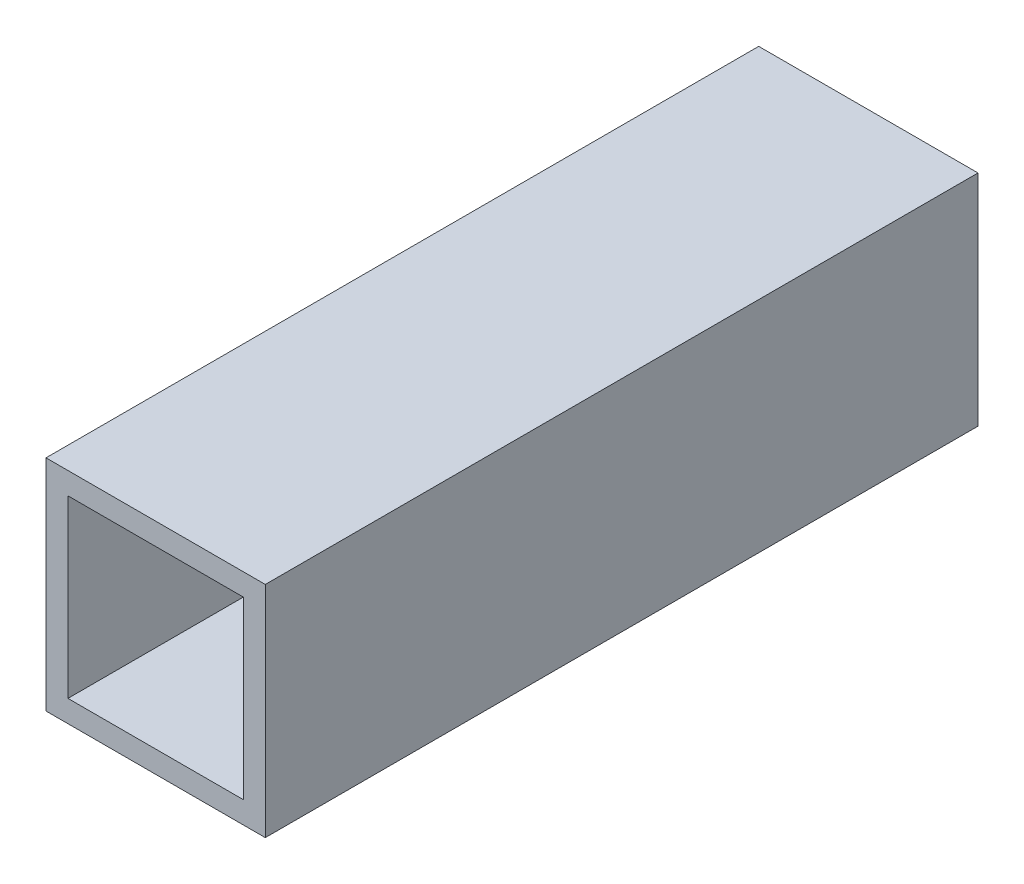
ISO-10303-21;
HEADER;
FILE_DESCRIPTION(('STEP AP214'),'2;1');
FILE_NAME('part.step','',(''),(''),'','','');
FILE_SCHEMA(('AUTOMOTIVE_DESIGN { 1 0 10303 214 1 1 1 1 }'));
ENDSEC;
DATA;
#1=APPLICATION_CONTEXT('core data for automotive mechanical design processes');
#2=APPLICATION_PROTOCOL_DEFINITION('international standard','automotive_design',2000,#1);
#3=PRODUCT_CONTEXT('',#1,'mechanical');
#4=PRODUCT('Part','Part','',(#3));
#5=PRODUCT_RELATED_PRODUCT_CATEGORY('part','',(#4));
#6=PRODUCT_DEFINITION_FORMATION('','',#4);
#7=PRODUCT_DEFINITION_CONTEXT('part definition',#1,'design');
#8=PRODUCT_DEFINITION('design','',#6,#7);
#9=PRODUCT_DEFINITION_SHAPE('','',#8);
#10=(LENGTH_UNIT() NAMED_UNIT(*) SI_UNIT(.MILLI.,.METRE.));
#11=(NAMED_UNIT(*) PLANE_ANGLE_UNIT() SI_UNIT($,.RADIAN.));
#12=(NAMED_UNIT(*) SI_UNIT($,.STERADIAN.) SOLID_ANGLE_UNIT());
#13=UNCERTAINTY_MEASURE_WITH_UNIT(LENGTH_MEASURE(1.E-05),#10,'distance_accuracy_value','');
#14=(GEOMETRIC_REPRESENTATION_CONTEXT(3) GLOBAL_UNCERTAINTY_ASSIGNED_CONTEXT((#13)) GLOBAL_UNIT_ASSIGNED_CONTEXT((#10,
#11,#12)) REPRESENTATION_CONTEXT('',''));
#15=CARTESIAN_POINT('',(0.,0.,0.));
#16=DIRECTION('',(0.,0.,1.));
#17=DIRECTION('',(1.,0.,0.));
#18=AXIS2_PLACEMENT_3D('',#15,#16,#17);
#19=CARTESIAN_POINT('',(0.,0.,130.));
#20=DIRECTION('',(0.,0.,-1.));
#21=DIRECTION('',(-1.,0.,0.));
#22=AXIS2_PLACEMENT_3D('',#19,#20,#21);
#23=PLANE('',#22);
#24=DIRECTION('',(0.,-1.,0.));
#25=VECTOR('',#24,1.);
#26=CARTESIAN_POINT('',(0.,0.,130.));
#27=LINE('',#26,#25);
#28=CARTESIAN_POINT('',(0.,40.,130.));
#29=VERTEX_POINT('',#28);
#30=CARTESIAN_POINT('',(0.,0.,130.));
#31=VERTEX_POINT('',#30);
#32=EDGE_CURVE('E138',#29,#31,#27,.T.);
#33=ORIENTED_EDGE('',*,*,#32,.T.);
#34=DIRECTION('',(1.,0.,0.));
#35=VECTOR('',#34,1.);
#36=CARTESIAN_POINT('',(0.,0.,130.));
#37=LINE('',#36,#35);
#38=CARTESIAN_POINT('',(40.,0.,130.));
#39=VERTEX_POINT('',#38);
#40=EDGE_CURVE('E141',#31,#39,#37,.T.);
#41=ORIENTED_EDGE('',*,*,#40,.T.);
#42=DIRECTION('',(0.,1.,0.));
#43=VECTOR('',#42,1.);
#44=CARTESIAN_POINT('',(40.,0.,130.));
#45=LINE('',#44,#43);
#46=CARTESIAN_POINT('',(40.,40.,130.));
#47=VERTEX_POINT('',#46);
#48=EDGE_CURVE('E144',#39,#47,#45,.T.);
#49=ORIENTED_EDGE('',*,*,#48,.T.);
#50=DIRECTION('',(-1.,0.,0.));
#51=VECTOR('',#50,1.);
#52=CARTESIAN_POINT('',(0.,40.,130.));
#53=LINE('',#52,#51);
#54=EDGE_CURVE('E146',#47,#29,#53,.T.);
#55=ORIENTED_EDGE('',*,*,#54,.T.);
#56=EDGE_LOOP('',(#33,#41,#49,#55));
#57=FACE_BOUND('',#56,.T.);
#58=DIRECTION('',(0.,-1.,0.));
#59=VECTOR('',#58,1.);
#60=CARTESIAN_POINT('',(4.,4.,130.));
#61=LINE('',#60,#59);
#62=CARTESIAN_POINT('',(4.,36.,130.));
#63=VERTEX_POINT('',#62);
#64=CARTESIAN_POINT('',(4.,4.,130.));
#65=VERTEX_POINT('',#64);
#66=EDGE_CURVE('E102',#63,#65,#61,.T.);
#67=ORIENTED_EDGE('',*,*,#66,.F.);
#68=DIRECTION('',(-1.,0.,0.));
#69=VECTOR('',#68,1.);
#70=CARTESIAN_POINT('',(4.,36.,130.));
#71=LINE('',#70,#69);
#72=CARTESIAN_POINT('',(36.,36.,130.));
#73=VERTEX_POINT('',#72);
#74=EDGE_CURVE('E124',#73,#63,#71,.T.);
#75=ORIENTED_EDGE('',*,*,#74,.F.);
#76=DIRECTION('',(0.,1.,0.));
#77=VECTOR('',#76,1.);
#78=CARTESIAN_POINT('',(36.,4.,130.));
#79=LINE('',#78,#77);
#80=CARTESIAN_POINT('',(36.,4.,130.));
#81=VERTEX_POINT('',#80);
#82=EDGE_CURVE('E122',#81,#73,#79,.T.);
#83=ORIENTED_EDGE('',*,*,#82,.F.);
#84=DIRECTION('',(1.,0.,0.));
#85=VECTOR('',#84,1.);
#86=CARTESIAN_POINT('',(4.,4.,130.));
#87=LINE('',#86,#85);
#88=EDGE_CURVE('E110',#65,#81,#87,.T.);
#89=ORIENTED_EDGE('',*,*,#88,.F.);
#90=EDGE_LOOP('',(#67,#75,#83,#89));
#91=FACE_BOUND('',#90,.T.);
#92=ADVANCED_FACE('F37',(#57,#91),#23,.F.);
#93=CARTESIAN_POINT('',(0.,0.,0.));
#94=DIRECTION('',(0.,0.,-1.));
#95=DIRECTION('',(-1.,0.,0.));
#96=AXIS2_PLACEMENT_3D('',#93,#94,#95);
#97=PLANE('',#96);
#98=DIRECTION('',(0.,-1.,0.));
#99=VECTOR('',#98,1.);
#100=CARTESIAN_POINT('',(0.,0.,0.));
#101=LINE('',#100,#99);
#102=CARTESIAN_POINT('',(0.,40.,0.));
#103=VERTEX_POINT('',#102);
#104=CARTESIAN_POINT('',(0.,0.,0.));
#105=VERTEX_POINT('',#104);
#106=EDGE_CURVE('E118',#103,#105,#101,.T.);
#107=ORIENTED_EDGE('',*,*,#106,.F.);
#108=DIRECTION('',(-1.,0.,0.));
#109=VECTOR('',#108,1.);
#110=CARTESIAN_POINT('',(0.,40.,0.));
#111=LINE('',#110,#109);
#112=CARTESIAN_POINT('',(40.,40.,0.));
#113=VERTEX_POINT('',#112);
#114=EDGE_CURVE('E142',#113,#103,#111,.T.);
#115=ORIENTED_EDGE('',*,*,#114,.F.);
#116=DIRECTION('',(0.,1.,0.));
#117=VECTOR('',#116,1.);
#118=CARTESIAN_POINT('',(40.,0.,0.));
#119=LINE('',#118,#117);
#120=CARTESIAN_POINT('',(40.,0.,0.));
#121=VERTEX_POINT('',#120);
#122=EDGE_CURVE('E153',#121,#113,#119,.T.);
#123=ORIENTED_EDGE('',*,*,#122,.F.);
#124=DIRECTION('',(1.,0.,0.));
#125=VECTOR('',#124,1.);
#126=CARTESIAN_POINT('',(0.,0.,0.));
#127=LINE('',#126,#125);
#128=EDGE_CURVE('E151',#105,#121,#127,.T.);
#129=ORIENTED_EDGE('',*,*,#128,.F.);
#130=EDGE_LOOP('',(#107,#115,#123,#129));
#131=FACE_BOUND('',#130,.T.);
#132=DIRECTION('',(-1.,0.,0.));
#133=VECTOR('',#132,1.);
#134=CARTESIAN_POINT('',(4.,36.,0.));
#135=LINE('',#134,#133);
#136=CARTESIAN_POINT('',(36.,36.,0.));
#137=VERTEX_POINT('',#136);
#138=CARTESIAN_POINT('',(4.,36.,0.));
#139=VERTEX_POINT('',#138);
#140=EDGE_CURVE('E111',#137,#139,#135,.T.);
#141=ORIENTED_EDGE('',*,*,#140,.T.);
#142=DIRECTION('',(0.,-1.,0.));
#143=VECTOR('',#142,1.);
#144=CARTESIAN_POINT('',(4.,4.,0.));
#145=LINE('',#144,#143);
#146=CARTESIAN_POINT('',(4.,4.,0.));
#147=VERTEX_POINT('',#146);
#148=EDGE_CURVE('E60',#139,#147,#145,.T.);
#149=ORIENTED_EDGE('',*,*,#148,.T.);
#150=DIRECTION('',(1.,0.,0.));
#151=VECTOR('',#150,1.);
#152=CARTESIAN_POINT('',(4.,4.,0.));
#153=LINE('',#152,#151);
#154=CARTESIAN_POINT('',(36.,4.,0.));
#155=VERTEX_POINT('',#154);
#156=EDGE_CURVE('E117',#147,#155,#153,.T.);
#157=ORIENTED_EDGE('',*,*,#156,.T.);
#158=DIRECTION('',(0.,1.,0.));
#159=VECTOR('',#158,1.);
#160=CARTESIAN_POINT('',(36.,4.,0.));
#161=LINE('',#160,#159);
#162=EDGE_CURVE('E130',#155,#137,#161,.T.);
#163=ORIENTED_EDGE('',*,*,#162,.T.);
#164=EDGE_LOOP('',(#141,#149,#157,#163));
#165=FACE_BOUND('',#164,.T.);
#166=ADVANCED_FACE('F171',(#131,#165),#97,.T.);
#167=CARTESIAN_POINT('',(0.,0.,130.));
#168=DIRECTION('',(1.,0.,0.));
#169=DIRECTION('',(0.,0.,-1.));
#170=AXIS2_PLACEMENT_3D('',#167,#168,#169);
#171=PLANE('',#170);
#172=ORIENTED_EDGE('',*,*,#106,.T.);
#173=DIRECTION('',(0.,0.,-1.));
#174=VECTOR('',#173,1.);
#175=CARTESIAN_POINT('',(0.,0.,130.));
#176=LINE('',#175,#174);
#177=EDGE_CURVE('E11',#31,#105,#176,.T.);
#178=ORIENTED_EDGE('',*,*,#177,.F.);
#179=ORIENTED_EDGE('',*,*,#32,.F.);
#180=DIRECTION('',(0.,0.,-1.));
#181=VECTOR('',#180,1.);
#182=CARTESIAN_POINT('',(0.,40.,130.));
#183=LINE('',#182,#181);
#184=EDGE_CURVE('E148',#29,#103,#183,.T.);
#185=ORIENTED_EDGE('',*,*,#184,.T.);
#186=EDGE_LOOP('',(#172,#178,#179,#185));
#187=FACE_BOUND('',#186,.T.);
#188=ADVANCED_FACE('F39',(#187),#171,.F.);
#189=CARTESIAN_POINT('',(0.,0.,130.));
#190=DIRECTION('',(0.,1.,0.));
#191=DIRECTION('',(0.,0.,1.));
#192=AXIS2_PLACEMENT_3D('',#189,#190,#191);
#193=PLANE('',#192);
#194=ORIENTED_EDGE('',*,*,#128,.T.);
#195=DIRECTION('',(0.,0.,-1.));
#196=VECTOR('',#195,1.);
#197=CARTESIAN_POINT('',(40.,0.,130.));
#198=LINE('',#197,#196);
#199=EDGE_CURVE('E45',#39,#121,#198,.T.);
#200=ORIENTED_EDGE('',*,*,#199,.F.);
#201=ORIENTED_EDGE('',*,*,#40,.F.);
#202=ORIENTED_EDGE('',*,*,#177,.T.);
#203=EDGE_LOOP('',(#194,#200,#201,#202));
#204=FACE_BOUND('',#203,.T.);
#205=ADVANCED_FACE('F181',(#204),#193,.F.);
#206=CARTESIAN_POINT('',(40.,0.,130.));
#207=DIRECTION('',(-1.,0.,0.));
#208=DIRECTION('',(0.,0.,1.));
#209=AXIS2_PLACEMENT_3D('',#206,#207,#208);
#210=PLANE('',#209);
#211=ORIENTED_EDGE('',*,*,#122,.T.);
#212=DIRECTION('',(0.,0.,-1.));
#213=VECTOR('',#212,1.);
#214=CARTESIAN_POINT('',(40.,40.,130.));
#215=LINE('',#214,#213);
#216=EDGE_CURVE('E158',#47,#113,#215,.T.);
#217=ORIENTED_EDGE('',*,*,#216,.F.);
#218=ORIENTED_EDGE('',*,*,#48,.F.);
#219=ORIENTED_EDGE('',*,*,#199,.T.);
#220=EDGE_LOOP('',(#211,#217,#218,#219));
#221=FACE_BOUND('',#220,.T.);
#222=ADVANCED_FACE('F165',(#221),#210,.F.);
#223=CARTESIAN_POINT('',(0.,40.,130.));
#224=DIRECTION('',(0.,-1.,0.));
#225=DIRECTION('',(0.,0.,-1.));
#226=AXIS2_PLACEMENT_3D('',#223,#224,#225);
#227=PLANE('',#226);
#228=ORIENTED_EDGE('',*,*,#114,.T.);
#229=ORIENTED_EDGE('',*,*,#184,.F.);
#230=ORIENTED_EDGE('',*,*,#54,.F.);
#231=ORIENTED_EDGE('',*,*,#216,.T.);
#232=EDGE_LOOP('',(#228,#229,#230,#231));
#233=FACE_BOUND('',#232,.T.);
#234=ADVANCED_FACE('F175',(#233),#227,.F.);
#235=CARTESIAN_POINT('',(4.,4.,130.));
#236=DIRECTION('',(1.,0.,0.));
#237=DIRECTION('',(0.,0.,-1.));
#238=AXIS2_PLACEMENT_3D('',#235,#236,#237);
#239=PLANE('',#238);
#240=ORIENTED_EDGE('',*,*,#148,.F.);
#241=DIRECTION('',(0.,0.,-1.));
#242=VECTOR('',#241,1.);
#243=CARTESIAN_POINT('',(4.,36.,130.));
#244=LINE('',#243,#242);
#245=EDGE_CURVE('E106',#63,#139,#244,.T.);
#246=ORIENTED_EDGE('',*,*,#245,.F.);
#247=ORIENTED_EDGE('',*,*,#66,.T.);
#248=DIRECTION('',(0.,0.,-1.));
#249=VECTOR('',#248,1.);
#250=CARTESIAN_POINT('',(4.,4.,130.));
#251=LINE('',#250,#249);
#252=EDGE_CURVE('E105',#65,#147,#251,.T.);
#253=ORIENTED_EDGE('',*,*,#252,.T.);
#254=EDGE_LOOP('',(#240,#246,#247,#253));
#255=FACE_BOUND('',#254,.T.);
#256=ADVANCED_FACE('F104',(#255),#239,.T.);
#257=CARTESIAN_POINT('',(4.,4.,130.));
#258=DIRECTION('',(0.,1.,0.));
#259=DIRECTION('',(-1.,0.,0.));
#260=AXIS2_PLACEMENT_3D('',#257,#258,#259);
#261=PLANE('',#260);
#262=ORIENTED_EDGE('',*,*,#156,.F.);
#263=ORIENTED_EDGE('',*,*,#252,.F.);
#264=ORIENTED_EDGE('',*,*,#88,.T.);
#265=DIRECTION('',(0.,0.,-1.));
#266=VECTOR('',#265,1.);
#267=CARTESIAN_POINT('',(36.,4.,130.));
#268=LINE('',#267,#266);
#269=EDGE_CURVE('E119',#81,#155,#268,.T.);
#270=ORIENTED_EDGE('',*,*,#269,.T.);
#271=EDGE_LOOP('',(#262,#263,#264,#270));
#272=FACE_BOUND('',#271,.T.);
#273=ADVANCED_FACE('F114',(#272),#261,.T.);
#274=CARTESIAN_POINT('',(36.,4.,130.));
#275=DIRECTION('',(-1.,0.,0.));
#276=DIRECTION('',(0.,0.,1.));
#277=AXIS2_PLACEMENT_3D('',#274,#275,#276);
#278=PLANE('',#277);
#279=ORIENTED_EDGE('',*,*,#162,.F.);
#280=ORIENTED_EDGE('',*,*,#269,.F.);
#281=ORIENTED_EDGE('',*,*,#82,.T.);
#282=DIRECTION('',(0.,0.,-1.));
#283=VECTOR('',#282,1.);
#284=CARTESIAN_POINT('',(36.,36.,130.));
#285=LINE('',#284,#283);
#286=EDGE_CURVE('E52',#73,#137,#285,.T.);
#287=ORIENTED_EDGE('',*,*,#286,.T.);
#288=EDGE_LOOP('',(#279,#280,#281,#287));
#289=FACE_BOUND('',#288,.T.);
#290=ADVANCED_FACE('F204',(#289),#278,.T.);
#291=CARTESIAN_POINT('',(4.,36.,130.));
#292=DIRECTION('',(0.,-1.,0.));
#293=DIRECTION('',(0.,0.,-1.));
#294=AXIS2_PLACEMENT_3D('',#291,#292,#293);
#295=PLANE('',#294);
#296=ORIENTED_EDGE('',*,*,#140,.F.);
#297=ORIENTED_EDGE('',*,*,#286,.F.);
#298=ORIENTED_EDGE('',*,*,#74,.T.);
#299=ORIENTED_EDGE('',*,*,#245,.T.);
#300=EDGE_LOOP('',(#296,#297,#298,#299));
#301=FACE_BOUND('',#300,.T.);
#302=ADVANCED_FACE('F208',(#301),#295,.T.);
#303=CLOSED_SHELL('',(#92,#166,#188,#205,#222,#234,#256,#273,#290,#302));
#304=MANIFOLD_SOLID_BREP('B2',#303);
#305=ADVANCED_BREP_SHAPE_REPRESENTATION('',(#18,#304),#14);
#306=SHAPE_DEFINITION_REPRESENTATION(#9,#305);
ENDSEC;
END-ISO-10303-21;
